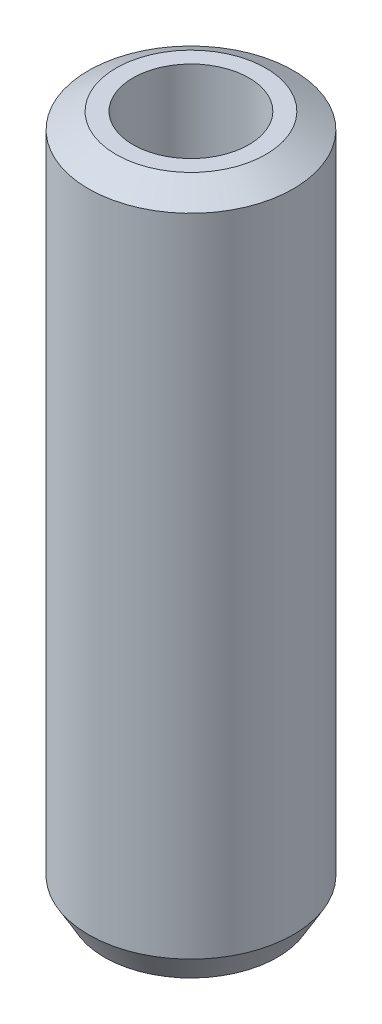
ISO-10303-21;
HEADER;
FILE_DESCRIPTION(('STEP AP214'),'2;1');
FILE_NAME('part.step','',(''),(''),'','','');
FILE_SCHEMA(('AUTOMOTIVE_DESIGN { 1 0 10303 214 1 1 1 1 }'));
ENDSEC;
DATA;
#1=APPLICATION_CONTEXT('core data for automotive mechanical design processes');
#2=APPLICATION_PROTOCOL_DEFINITION('international standard','automotive_design',2000,#1);
#3=PRODUCT_CONTEXT('',#1,'mechanical');
#4=PRODUCT('Part','Part','',(#3));
#5=PRODUCT_RELATED_PRODUCT_CATEGORY('part','',(#4));
#6=PRODUCT_DEFINITION_FORMATION('','',#4);
#7=PRODUCT_DEFINITION_CONTEXT('part definition',#1,'design');
#8=PRODUCT_DEFINITION('design','',#6,#7);
#9=PRODUCT_DEFINITION_SHAPE('','',#8);
#10=(LENGTH_UNIT() NAMED_UNIT(*) SI_UNIT(.MILLI.,.METRE.));
#11=(NAMED_UNIT(*) PLANE_ANGLE_UNIT() SI_UNIT($,.RADIAN.));
#12=(NAMED_UNIT(*) SI_UNIT($,.STERADIAN.) SOLID_ANGLE_UNIT());
#13=UNCERTAINTY_MEASURE_WITH_UNIT(LENGTH_MEASURE(1.E-05),#10,'distance_accuracy_value','');
#14=(GEOMETRIC_REPRESENTATION_CONTEXT(3) GLOBAL_UNCERTAINTY_ASSIGNED_CONTEXT((#13)) GLOBAL_UNIT_ASSIGNED_CONTEXT((#10,
#11,#12)) REPRESENTATION_CONTEXT('',''));
#15=CARTESIAN_POINT('',(0.,0.,0.));
#16=DIRECTION('',(0.,0.,1.));
#17=DIRECTION('',(1.,0.,0.));
#18=AXIS2_PLACEMENT_3D('',#15,#16,#17);
#19=CARTESIAN_POINT('',(0.,252.290378689544,0.));
#20=DIRECTION('',(0.,-1.,0.));
#21=DIRECTION('',(0.,0.,-1.));
#22=AXIS2_PLACEMENT_3D('',#19,#20,#21);
#23=CYLINDRICAL_SURFACE('',#22,37.5);
#24=CARTESIAN_POINT('',(0.,246.465953948449,0.));
#25=DIRECTION('',(0.,1.,0.));
#26=DIRECTION('',(0.,0.,1.));
#27=AXIS2_PLACEMENT_3D('',#24,#25,#26);
#28=CIRCLE('',#27,37.5);
#29=CARTESIAN_POINT('',(0.,246.465953948449,37.5));
#30=VERTEX_POINT('',#29);
#31=EDGE_CURVE('E50',#30,#30,#28,.F.);
#32=ORIENTED_EDGE('',*,*,#31,.T.);
#33=EDGE_LOOP('',(#32));
#34=FACE_BOUND('',#33,.T.);
#35=CARTESIAN_POINT('',(0.,10.0881995764375,0.));
#36=DIRECTION('',(0.,1.,0.));
#37=DIRECTION('',(0.,0.,1.));
#38=AXIS2_PLACEMENT_3D('',#35,#36,#37);
#39=CIRCLE('',#38,37.5);
#40=CARTESIAN_POINT('',(0.,10.0881995764375,37.5));
#41=VERTEX_POINT('',#40);
#42=EDGE_CURVE('E51',#41,#41,#39,.T.);
#43=ORIENTED_EDGE('',*,*,#42,.T.);
#44=EDGE_LOOP('',(#43));
#45=FACE_BOUND('',#44,.T.);
#46=ADVANCED_FACE('F39',(#34,#45),#23,.T.);
#47=CARTESIAN_POINT('',(0.,252.290378689544,0.));
#48=DIRECTION('',(0.,1.,0.));
#49=DIRECTION('',(0.,0.,1.));
#50=AXIS2_PLACEMENT_3D('',#47,#48,#49);
#51=PLANE('',#50);
#52=CARTESIAN_POINT('',(0.,252.290378689544,0.));
#53=DIRECTION('',(0.,1.,0.));
#54=DIRECTION('',(0.,0.,1.));
#55=AXIS2_PLACEMENT_3D('',#52,#53,#54);
#56=CIRCLE('',#55,27.4118004235624);
#57=CARTESIAN_POINT('',(0.,252.290378689544,27.4118004235624));
#58=VERTEX_POINT('',#57);
#59=EDGE_CURVE('E54',#58,#58,#56,.T.);
#60=ORIENTED_EDGE('',*,*,#59,.T.);
#61=EDGE_LOOP('',(#60));
#62=FACE_BOUND('',#61,.T.);
#63=CARTESIAN_POINT('',(0.,252.290378689544,0.));
#64=DIRECTION('',(0.,1.,0.));
#65=DIRECTION('',(0.,0.,1.));
#66=AXIS2_PLACEMENT_3D('',#63,#64,#65);
#67=CIRCLE('',#66,21.204317450335);
#68=CARTESIAN_POINT('',(0.,252.290378689544,21.204317450335));
#69=VERTEX_POINT('',#68);
#70=EDGE_CURVE('E58',#69,#69,#67,.T.);
#71=ORIENTED_EDGE('',*,*,#70,.F.);
#72=EDGE_LOOP('',(#71));
#73=FACE_BOUND('',#72,.T.);
#74=ADVANCED_FACE('F69',(#62,#73),#51,.T.);
#75=CARTESIAN_POINT('',(0.,0.,0.));
#76=DIRECTION('',(0.,1.,0.));
#77=DIRECTION('',(0.,0.,1.));
#78=AXIS2_PLACEMENT_3D('',#75,#76,#77);
#79=PLANE('',#78);
#80=CARTESIAN_POINT('',(0.,0.,0.));
#81=DIRECTION('',(0.,1.,0.));
#82=DIRECTION('',(0.,0.,1.));
#83=AXIS2_PLACEMENT_3D('',#80,#81,#82);
#84=CIRCLE('',#83,31.6755752589051);
#85=CARTESIAN_POINT('',(0.,0.,31.6755752589051));
#86=VERTEX_POINT('',#85);
#87=EDGE_CURVE('E10',#86,#86,#84,.F.);
#88=ORIENTED_EDGE('',*,*,#87,.T.);
#89=EDGE_LOOP('',(#88));
#90=FACE_BOUND('',#89,.T.);
#91=CARTESIAN_POINT('',(0.,0.,0.));
#92=DIRECTION('',(0.,1.,0.));
#93=DIRECTION('',(0.,0.,1.));
#94=AXIS2_PLACEMENT_3D('',#91,#92,#93);
#95=CIRCLE('',#94,21.204317450335);
#96=CARTESIAN_POINT('',(0.,0.,21.204317450335));
#97=VERTEX_POINT('',#96);
#98=EDGE_CURVE('E63',#97,#97,#95,.T.);
#99=ORIENTED_EDGE('',*,*,#98,.T.);
#100=EDGE_LOOP('',(#99));
#101=FACE_BOUND('',#100,.T.);
#102=ADVANCED_FACE('F75',(#90,#101),#79,.F.);
#103=CARTESIAN_POINT('',(0.,252.290378689544,0.));
#104=DIRECTION('',(0.,-1.,0.));
#105=DIRECTION('',(0.,0.,-1.));
#106=AXIS2_PLACEMENT_3D('',#103,#104,#105);
#107=CYLINDRICAL_SURFACE('',#106,21.204317450335);
#108=ORIENTED_EDGE('',*,*,#70,.T.);
#109=EDGE_LOOP('',(#108));
#110=FACE_BOUND('',#109,.T.);
#111=ORIENTED_EDGE('',*,*,#98,.F.);
#112=EDGE_LOOP('',(#111));
#113=FACE_BOUND('',#112,.T.);
#114=ADVANCED_FACE('F70',(#110,#113),#107,.F.);
#115=CARTESIAN_POINT('',(0.,252.290378689544,0.));
#116=DIRECTION('',(0.,-1.,0.));
#117=DIRECTION('',(0.,0.,-1.));
#118=AXIS2_PLACEMENT_3D('',#115,#116,#117);
#119=CONICAL_SURFACE('',#118,27.4118004235624,1.04719755119659);
#120=ORIENTED_EDGE('',*,*,#31,.F.);
#121=EDGE_LOOP('',(#120));
#122=FACE_BOUND('',#121,.T.);
#123=ORIENTED_EDGE('',*,*,#59,.F.);
#124=EDGE_LOOP('',(#123));
#125=FACE_BOUND('',#124,.T.);
#126=ADVANCED_FACE('F81',(#122,#125),#119,.T.);
#127=CARTESIAN_POINT('',(0.,10.0881995764375,0.));
#128=DIRECTION('',(0.,1.,0.));
#129=DIRECTION('',(0.,0.,1.));
#130=AXIS2_PLACEMENT_3D('',#127,#128,#129);
#131=CONICAL_SURFACE('',#130,37.5,0.523598775598302);
#132=ORIENTED_EDGE('',*,*,#87,.F.);
#133=EDGE_LOOP('',(#132));
#134=FACE_BOUND('',#133,.T.);
#135=ORIENTED_EDGE('',*,*,#42,.F.);
#136=EDGE_LOOP('',(#135));
#137=FACE_BOUND('',#136,.T.);
#138=ADVANCED_FACE('F45',(#134,#137),#131,.T.);
#139=CLOSED_SHELL('',(#46,#74,#102,#114,#126,#138));
#140=MANIFOLD_SOLID_BREP('B2',#139);
#141=ADVANCED_BREP_SHAPE_REPRESENTATION('',(#18,#140),#14);
#142=SHAPE_DEFINITION_REPRESENTATION(#9,#141);
ENDSEC;
END-ISO-10303-21;
